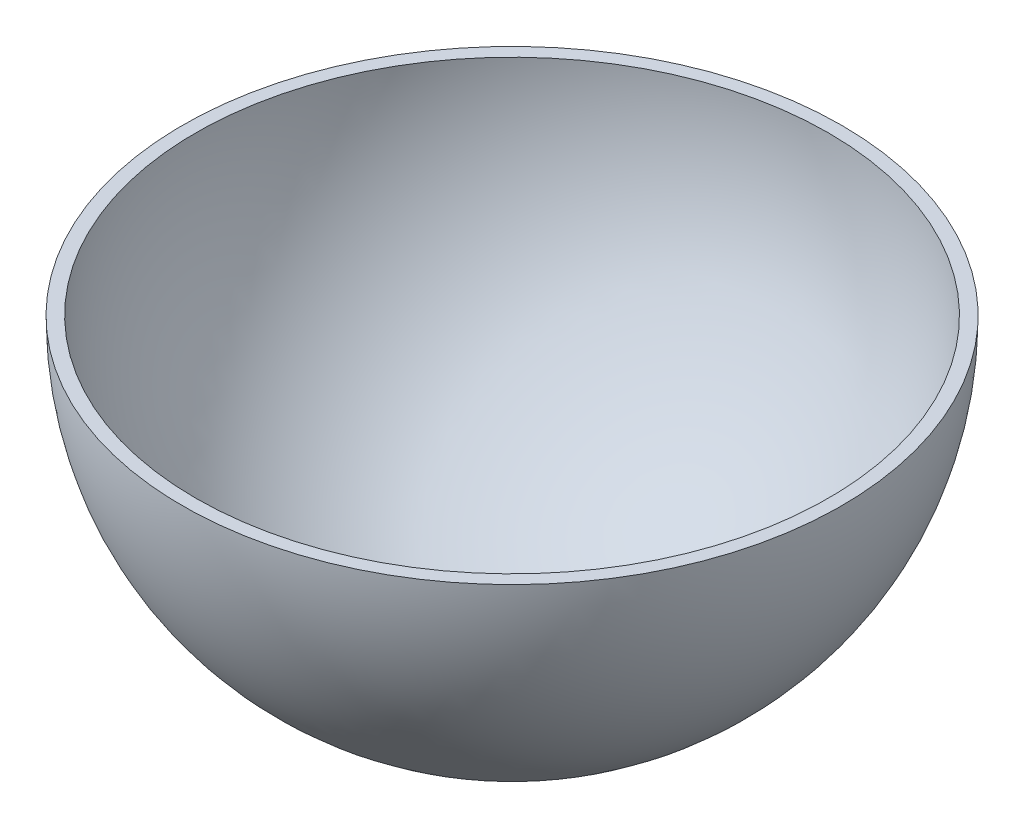
ISO-10303-21;
HEADER;
FILE_DESCRIPTION(('STEP AP214'),'2;1');
FILE_NAME('part.step','',(''),(''),'','','');
FILE_SCHEMA(('AUTOMOTIVE_DESIGN { 1 0 10303 214 1 1 1 1 }'));
ENDSEC;
DATA;
#1=APPLICATION_CONTEXT('core data for automotive mechanical design processes');
#2=APPLICATION_PROTOCOL_DEFINITION('international standard','automotive_design',2000,#1);
#3=PRODUCT_CONTEXT('',#1,'mechanical');
#4=PRODUCT('Part','Part','',(#3));
#5=PRODUCT_RELATED_PRODUCT_CATEGORY('part','',(#4));
#6=PRODUCT_DEFINITION_FORMATION('','',#4);
#7=PRODUCT_DEFINITION_CONTEXT('part definition',#1,'design');
#8=PRODUCT_DEFINITION('design','',#6,#7);
#9=PRODUCT_DEFINITION_SHAPE('','',#8);
#10=(LENGTH_UNIT() NAMED_UNIT(*) SI_UNIT(.MILLI.,.METRE.));
#11=(NAMED_UNIT(*) PLANE_ANGLE_UNIT() SI_UNIT($,.RADIAN.));
#12=(NAMED_UNIT(*) SI_UNIT($,.STERADIAN.) SOLID_ANGLE_UNIT());
#13=UNCERTAINTY_MEASURE_WITH_UNIT(LENGTH_MEASURE(1.E-05),#10,'distance_accuracy_value','');
#14=(GEOMETRIC_REPRESENTATION_CONTEXT(3) GLOBAL_UNCERTAINTY_ASSIGNED_CONTEXT((#13)) GLOBAL_UNIT_ASSIGNED_CONTEXT((#10,
#11,#12)) REPRESENTATION_CONTEXT('',''));
#15=CARTESIAN_POINT('',(0.,0.,0.));
#16=DIRECTION('',(0.,0.,1.));
#17=DIRECTION('',(1.,0.,0.));
#18=AXIS2_PLACEMENT_3D('',#15,#16,#17);
#19=CARTESIAN_POINT('',(0.,114.78240283249,0.));
#20=DIRECTION('',(0.,1.,0.));
#21=DIRECTION('',(0.,0.,1.));
#22=AXIS2_PLACEMENT_3D('',#19,#20,#21);
#23=PLANE('',#22);
#24=CARTESIAN_POINT('',(0.,114.78240283249,0.));
#25=DIRECTION('',(0.,-1.,0.));
#26=DIRECTION('',(0.,0.,-1.));
#27=AXIS2_PLACEMENT_3D('',#24,#25,#26);
#28=CIRCLE('',#27,125.);
#29=CARTESIAN_POINT('',(0.,114.78240283249,-125.));
#30=VERTEX_POINT('',#29);
#31=EDGE_CURVE('E10',#30,#30,#28,.T.);
#32=ORIENTED_EDGE('',*,*,#31,.F.);
#33=EDGE_LOOP('',(#32));
#34=FACE_BOUND('',#33,.T.);
#35=CARTESIAN_POINT('',(0.,114.78240283249,0.));
#36=DIRECTION('',(0.,-1.,0.));
#37=DIRECTION('',(0.,0.,-1.));
#38=AXIS2_PLACEMENT_3D('',#35,#36,#37);
#39=CIRCLE('',#38,120.);
#40=CARTESIAN_POINT('',(0.,114.78240283249,-120.));
#41=VERTEX_POINT('',#40);
#42=EDGE_CURVE('E48',#41,#41,#39,.T.);
#43=ORIENTED_EDGE('',*,*,#42,.T.);
#44=EDGE_LOOP('',(#43));
#45=FACE_BOUND('',#44,.T.);
#46=ADVANCED_FACE('F36',(#34,#45),#23,.T.);
#47=CARTESIAN_POINT('',(35.,-5.,0.));
#48=DIRECTION('',(0.,-1.,0.));
#49=DIRECTION('',(0.,0.,-1.));
#50=AXIS2_PLACEMENT_3D('',#47,#48,#49);
#51=PLANE('',#50);
#52=CARTESIAN_POINT('',(0.,-5.,0.));
#53=DIRECTION('',(0.,-1.,0.));
#54=DIRECTION('',(0.,0.,-1.));
#55=AXIS2_PLACEMENT_3D('',#52,#53,#54);
#56=CIRCLE('',#55,35.7375988515611);
#57=CARTESIAN_POINT('',(0.,-5.,-35.7375988515611));
#58=VERTEX_POINT('',#57);
#59=EDGE_CURVE('E43',#58,#58,#56,.T.);
#60=ORIENTED_EDGE('',*,*,#59,.T.);
#61=EDGE_LOOP('',(#60));
#62=FACE_BOUND('',#61,.T.);
#63=ADVANCED_FACE('F67',(#62),#51,.T.);
#64=CARTESIAN_POINT('',(0.,114.78240283249,0.));
#65=DIRECTION('',(0.,-1.,0.));
#66=DIRECTION('',(1.,0.,0.));
#67=AXIS2_PLACEMENT_3D('',#64,#65,#66);
#68=SPHERICAL_SURFACE('',#67,125.);
#69=ORIENTED_EDGE('',*,*,#31,.T.);
#70=EDGE_LOOP('',(#69));
#71=FACE_BOUND('',#70,.T.);
#72=ORIENTED_EDGE('',*,*,#59,.F.);
#73=EDGE_LOOP('',(#72));
#74=FACE_BOUND('',#73,.T.);
#75=ADVANCED_FACE('F60',(#71,#74),#68,.T.);
#76=CARTESIAN_POINT('',(35.,0.,0.));
#77=DIRECTION('',(0.,-1.,0.));
#78=DIRECTION('',(0.,0.,-1.));
#79=AXIS2_PLACEMENT_3D('',#76,#77,#78);
#80=PLANE('',#79);
#81=CARTESIAN_POINT('',(0.,0.,0.));
#82=DIRECTION('',(0.,-1.,0.));
#83=DIRECTION('',(0.,0.,-1.));
#84=AXIS2_PLACEMENT_3D('',#81,#82,#83);
#85=CIRCLE('',#84,35.);
#86=CARTESIAN_POINT('',(0.,0.,-35.));
#87=VERTEX_POINT('',#86);
#88=EDGE_CURVE('E39',#87,#87,#85,.T.);
#89=ORIENTED_EDGE('',*,*,#88,.F.);
#90=EDGE_LOOP('',(#89));
#91=FACE_BOUND('',#90,.T.);
#92=ADVANCED_FACE('F58',(#91),#80,.F.);
#93=CARTESIAN_POINT('',(0.,114.78240283249,0.));
#94=DIRECTION('',(0.,-1.,0.));
#95=DIRECTION('',(1.,0.,0.));
#96=AXIS2_PLACEMENT_3D('',#93,#94,#95);
#97=SPHERICAL_SURFACE('',#96,120.);
#98=ORIENTED_EDGE('',*,*,#42,.F.);
#99=EDGE_LOOP('',(#98));
#100=FACE_BOUND('',#99,.T.);
#101=ORIENTED_EDGE('',*,*,#88,.T.);
#102=EDGE_LOOP('',(#101));
#103=FACE_BOUND('',#102,.T.);
#104=ADVANCED_FACE('F56',(#100,#103),#97,.F.);
#105=CLOSED_SHELL('',(#46,#63,#75,#92,#104));
#106=MANIFOLD_SOLID_BREP('B2',#105);
#107=ADVANCED_BREP_SHAPE_REPRESENTATION('',(#18,#106),#14);
#108=SHAPE_DEFINITION_REPRESENTATION(#9,#107);
ENDSEC;
END-ISO-10303-21;
